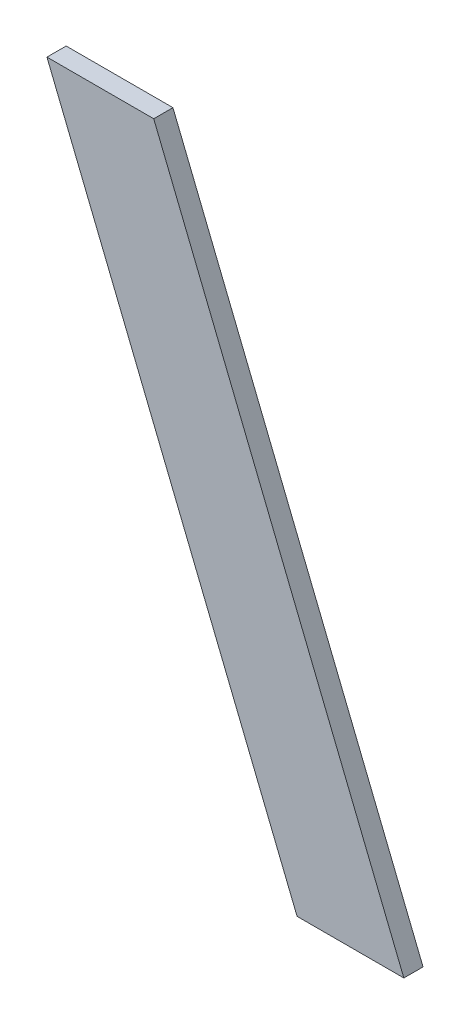
ISO-10303-21;
HEADER;
FILE_DESCRIPTION(('STEP AP214'),'2;1');
FILE_NAME('part.step','',(''),(''),'','','');
FILE_SCHEMA(('AUTOMOTIVE_DESIGN { 1 0 10303 214 1 1 1 1 }'));
ENDSEC;
DATA;
#1=APPLICATION_CONTEXT('core data for automotive mechanical design processes');
#2=APPLICATION_PROTOCOL_DEFINITION('international standard','automotive_design',2000,#1);
#3=PRODUCT_CONTEXT('',#1,'mechanical');
#4=PRODUCT('Part','Part','',(#3));
#5=PRODUCT_RELATED_PRODUCT_CATEGORY('part','',(#4));
#6=PRODUCT_DEFINITION_FORMATION('','',#4);
#7=PRODUCT_DEFINITION_CONTEXT('part definition',#1,'design');
#8=PRODUCT_DEFINITION('design','',#6,#7);
#9=PRODUCT_DEFINITION_SHAPE('','',#8);
#10=(LENGTH_UNIT() NAMED_UNIT(*) SI_UNIT(.MILLI.,.METRE.));
#11=(NAMED_UNIT(*) PLANE_ANGLE_UNIT() SI_UNIT($,.RADIAN.));
#12=(NAMED_UNIT(*) SI_UNIT($,.STERADIAN.) SOLID_ANGLE_UNIT());
#13=UNCERTAINTY_MEASURE_WITH_UNIT(LENGTH_MEASURE(1.E-05),#10,'distance_accuracy_value','');
#14=(GEOMETRIC_REPRESENTATION_CONTEXT(3) GLOBAL_UNCERTAINTY_ASSIGNED_CONTEXT((#13)) GLOBAL_UNIT_ASSIGNED_CONTEXT((#10,
#11,#12)) REPRESENTATION_CONTEXT('',''));
#15=CARTESIAN_POINT('',(0.,0.,0.));
#16=DIRECTION('',(0.,0.,1.));
#17=DIRECTION('',(1.,0.,0.));
#18=AXIS2_PLACEMENT_3D('',#15,#16,#17);
#19=CARTESIAN_POINT('',(0.031147565544146,-0.467683125106459,0.));
#20=DIRECTION('',(-0.927183854567092,-0.374606593415159,0.));
#21=DIRECTION('',(0.374606593415159,-0.927183854567092,0.));
#22=AXIS2_PLACEMENT_3D('',#19,#20,#21);
#23=PLANE('',#22);
#24=DIRECTION('',(0.374606593415159,-0.927183854567092,0.));
#25=VECTOR('',#24,1.);
#26=CARTESIAN_POINT('',(0.031147565544146,-0.467683125106459,0.));
#27=LINE('',#26,#25);
#28=CARTESIAN_POINT('',(0.031147565544146,-0.467683125106459,0.));
#29=VERTEX_POINT('',#28);
#30=CARTESIAN_POINT('',(0.0702152854774111,-0.56437912510646,0.));
#31=VERTEX_POINT('',#30);
#32=EDGE_CURVE('E11',#29,#31,#27,.T.);
#33=ORIENTED_EDGE('',*,*,#32,.T.);
#34=DIRECTION('',(0.,0.,1.));
#35=VECTOR('',#34,1.);
#36=CARTESIAN_POINT('',(0.0702152854774111,-0.56437912510646,0.));
#37=LINE('',#36,#35);
#38=CARTESIAN_POINT('',(0.0702152854774111,-0.56437912510646,0.003));
#39=VERTEX_POINT('',#38);
#40=EDGE_CURVE('E24',#31,#39,#37,.T.);
#41=ORIENTED_EDGE('',*,*,#40,.T.);
#42=DIRECTION('',(0.374606593415159,-0.927183854567092,0.));
#43=VECTOR('',#42,1.);
#44=CARTESIAN_POINT('',(0.031147565544146,-0.467683125106459,0.003));
#45=LINE('',#44,#43);
#46=CARTESIAN_POINT('',(0.031147565544146,-0.467683125106459,0.003));
#47=VERTEX_POINT('',#46);
#48=EDGE_CURVE('E75',#47,#39,#45,.T.);
#49=ORIENTED_EDGE('',*,*,#48,.F.);
#50=DIRECTION('',(0.,0.,1.));
#51=VECTOR('',#50,1.);
#52=CARTESIAN_POINT('',(0.031147565544146,-0.467683125106459,0.));
#53=LINE('',#52,#51);
#54=EDGE_CURVE('E86',#29,#47,#53,.T.);
#55=ORIENTED_EDGE('',*,*,#54,.F.);
#56=EDGE_LOOP('',(#33,#41,#49,#55));
#57=FACE_BOUND('',#56,.T.);
#58=ADVANCED_FACE('F17',(#57),#23,.T.);
#59=CARTESIAN_POINT('',(0.0478245655440611,-0.467683125106459,0.));
#60=DIRECTION('',(0.,1.,0.));
#61=DIRECTION('',(-1.,0.,0.));
#62=AXIS2_PLACEMENT_3D('',#59,#60,#61);
#63=PLANE('',#62);
#64=DIRECTION('',(-1.,0.,0.));
#65=VECTOR('',#64,1.);
#66=CARTESIAN_POINT('',(0.0478245655440611,-0.467683125106459,0.));
#67=LINE('',#66,#65);
#68=CARTESIAN_POINT('',(0.0478245655440611,-0.467683125106459,0.));
#69=VERTEX_POINT('',#68);
#70=EDGE_CURVE('E83',#69,#29,#67,.T.);
#71=ORIENTED_EDGE('',*,*,#70,.T.);
#72=ORIENTED_EDGE('',*,*,#54,.T.);
#73=DIRECTION('',(-1.,0.,0.));
#74=VECTOR('',#73,1.);
#75=CARTESIAN_POINT('',(0.0478245655440611,-0.467683125106459,0.003));
#76=LINE('',#75,#74);
#77=CARTESIAN_POINT('',(0.0478245655440611,-0.467683125106459,0.003));
#78=VERTEX_POINT('',#77);
#79=EDGE_CURVE('E81',#78,#47,#76,.T.);
#80=ORIENTED_EDGE('',*,*,#79,.F.);
#81=DIRECTION('',(0.,0.,1.));
#82=VECTOR('',#81,1.);
#83=CARTESIAN_POINT('',(0.0478245655440611,-0.467683125106459,0.));
#84=LINE('',#83,#82);
#85=EDGE_CURVE('E61',#69,#78,#84,.T.);
#86=ORIENTED_EDGE('',*,*,#85,.F.);
#87=EDGE_LOOP('',(#71,#72,#80,#86));
#88=FACE_BOUND('',#87,.T.);
#89=ADVANCED_FACE('F91',(#88),#63,.T.);
#90=CARTESIAN_POINT('',(0.0868922854774111,-0.56437912510646,0.));
#91=DIRECTION('',(0.927183854566809,0.374606593415859,0.));
#92=DIRECTION('',(-0.374606593415859,0.927183854566809,0.));
#93=AXIS2_PLACEMENT_3D('',#90,#91,#92);
#94=PLANE('',#93);
#95=DIRECTION('',(-0.374606593415859,0.927183854566809,0.));
#96=VECTOR('',#95,1.);
#97=CARTESIAN_POINT('',(0.0868922854774111,-0.56437912510646,0.));
#98=LINE('',#97,#96);
#99=CARTESIAN_POINT('',(0.0868922854774111,-0.56437912510646,0.));
#100=VERTEX_POINT('',#99);
#101=EDGE_CURVE('E65',#100,#69,#98,.T.);
#102=ORIENTED_EDGE('',*,*,#101,.T.);
#103=ORIENTED_EDGE('',*,*,#85,.T.);
#104=DIRECTION('',(-0.374606593415859,0.927183854566809,0.));
#105=VECTOR('',#104,1.);
#106=CARTESIAN_POINT('',(0.0868922854774111,-0.56437912510646,0.003));
#107=LINE('',#106,#105);
#108=CARTESIAN_POINT('',(0.0868922854774111,-0.56437912510646,0.003));
#109=VERTEX_POINT('',#108);
#110=EDGE_CURVE('E54',#109,#78,#107,.T.);
#111=ORIENTED_EDGE('',*,*,#110,.F.);
#112=DIRECTION('',(0.,0.,1.));
#113=VECTOR('',#112,1.);
#114=CARTESIAN_POINT('',(0.0868922854774111,-0.56437912510646,0.));
#115=LINE('',#114,#113);
#116=EDGE_CURVE('E58',#100,#109,#115,.T.);
#117=ORIENTED_EDGE('',*,*,#116,.F.);
#118=EDGE_LOOP('',(#102,#103,#111,#117));
#119=FACE_BOUND('',#118,.T.);
#120=ADVANCED_FACE('F57',(#119),#94,.T.);
#121=CARTESIAN_POINT('',(0.0702152854774111,-0.56437912510646,0.));
#122=DIRECTION('',(0.,-1.,0.));
#123=DIRECTION('',(1.,0.,0.));
#124=AXIS2_PLACEMENT_3D('',#121,#122,#123);
#125=PLANE('',#124);
#126=DIRECTION('',(1.,0.,0.));
#127=VECTOR('',#126,1.);
#128=CARTESIAN_POINT('',(0.0702152854774111,-0.56437912510646,0.));
#129=LINE('',#128,#127);
#130=EDGE_CURVE('E71',#31,#100,#129,.T.);
#131=ORIENTED_EDGE('',*,*,#130,.T.);
#132=ORIENTED_EDGE('',*,*,#116,.T.);
#133=DIRECTION('',(1.,0.,0.));
#134=VECTOR('',#133,1.);
#135=CARTESIAN_POINT('',(0.0702152854774111,-0.56437912510646,0.003));
#136=LINE('',#135,#134);
#137=EDGE_CURVE('E70',#39,#109,#136,.T.);
#138=ORIENTED_EDGE('',*,*,#137,.F.);
#139=ORIENTED_EDGE('',*,*,#40,.F.);
#140=EDGE_LOOP('',(#131,#132,#138,#139));
#141=FACE_BOUND('',#140,.T.);
#142=ADVANCED_FACE('F69',(#141),#125,.T.);
#143=CARTESIAN_POINT('',(0.0590199255107786,-0.51603112510646,0.003));
#144=DIRECTION('',(0.,0.,1.));
#145=DIRECTION('',(1.,0.,0.));
#146=AXIS2_PLACEMENT_3D('',#143,#144,#145);
#147=PLANE('',#146);
#148=ORIENTED_EDGE('',*,*,#137,.T.);
#149=ORIENTED_EDGE('',*,*,#110,.T.);
#150=ORIENTED_EDGE('',*,*,#79,.T.);
#151=ORIENTED_EDGE('',*,*,#48,.T.);
#152=EDGE_LOOP('',(#148,#149,#150,#151));
#153=FACE_BOUND('',#152,.T.);
#154=ADVANCED_FACE('F74',(#153),#147,.T.);
#155=CARTESIAN_POINT('',(0.0590199255107786,-0.51603112510646,0.));
#156=DIRECTION('',(0.,0.,1.));
#157=DIRECTION('',(1.,0.,0.));
#158=AXIS2_PLACEMENT_3D('',#155,#156,#157);
#159=PLANE('',#158);
#160=ORIENTED_EDGE('',*,*,#130,.F.);
#161=ORIENTED_EDGE('',*,*,#32,.F.);
#162=ORIENTED_EDGE('',*,*,#70,.F.);
#163=ORIENTED_EDGE('',*,*,#101,.F.);
#164=EDGE_LOOP('',(#160,#161,#162,#163));
#165=FACE_BOUND('',#164,.T.);
#166=ADVANCED_FACE('F89',(#165),#159,.F.);
#167=CLOSED_SHELL('',(#58,#89,#120,#142,#154,#166));
#168=MANIFOLD_SOLID_BREP('B1',#167);
#169=ADVANCED_BREP_SHAPE_REPRESENTATION('',(#18,#168),#14);
#170=SHAPE_DEFINITION_REPRESENTATION(#9,#169);
ENDSEC;
END-ISO-10303-21;
